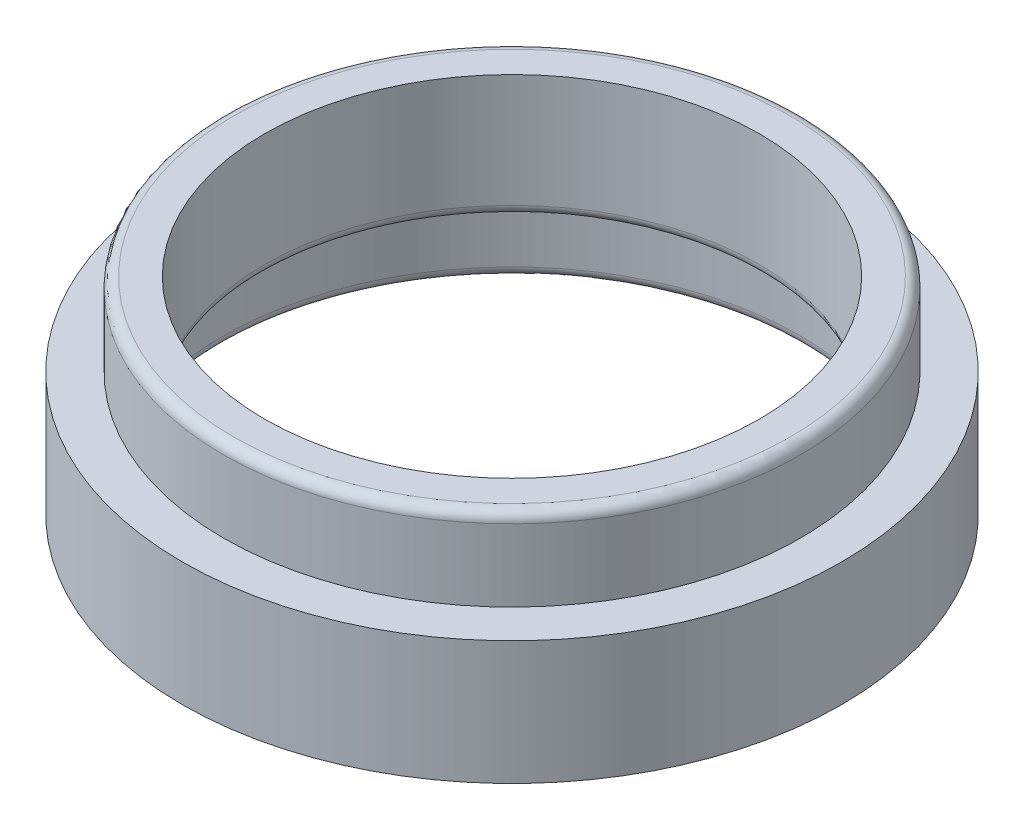
ISO-10303-21;
HEADER;
FILE_DESCRIPTION(('STEP AP214'),'2;1');
FILE_NAME('part.step','',(''),(''),'','','');
FILE_SCHEMA(('AUTOMOTIVE_DESIGN { 1 0 10303 214 1 1 1 1 }'));
ENDSEC;
DATA;
#1=APPLICATION_CONTEXT('core data for automotive mechanical design processes');
#2=APPLICATION_PROTOCOL_DEFINITION('international standard','automotive_design',2000,#1);
#3=PRODUCT_CONTEXT('',#1,'mechanical');
#4=PRODUCT('Part','Part','',(#3));
#5=PRODUCT_RELATED_PRODUCT_CATEGORY('part','',(#4));
#6=PRODUCT_DEFINITION_FORMATION('','',#4);
#7=PRODUCT_DEFINITION_CONTEXT('part definition',#1,'design');
#8=PRODUCT_DEFINITION('design','',#6,#7);
#9=PRODUCT_DEFINITION_SHAPE('','',#8);
#10=(LENGTH_UNIT() NAMED_UNIT(*) SI_UNIT(.MILLI.,.METRE.));
#11=(NAMED_UNIT(*) PLANE_ANGLE_UNIT() SI_UNIT($,.RADIAN.));
#12=(NAMED_UNIT(*) SI_UNIT($,.STERADIAN.) SOLID_ANGLE_UNIT());
#13=UNCERTAINTY_MEASURE_WITH_UNIT(LENGTH_MEASURE(1.E-05),#10,'distance_accuracy_value','');
#14=(GEOMETRIC_REPRESENTATION_CONTEXT(3) GLOBAL_UNCERTAINTY_ASSIGNED_CONTEXT((#13)) GLOBAL_UNIT_ASSIGNED_CONTEXT((#10,
#11,#12)) REPRESENTATION_CONTEXT('',''));
#15=CARTESIAN_POINT('',(0.,0.,0.));
#16=DIRECTION('',(0.,0.,1.));
#17=DIRECTION('',(1.,0.,0.));
#18=AXIS2_PLACEMENT_3D('',#15,#16,#17);
#19=CARTESIAN_POINT('',(0.,11.1125,-19.05));
#20=DIRECTION('',(0.,1.,0.));
#21=DIRECTION('',(0.,0.,1.));
#22=AXIS2_PLACEMENT_3D('',#19,#20,#21);
#23=PLANE('',#22);
#24=CARTESIAN_POINT('',(0.,11.1125,0.));
#25=DIRECTION('',(0.,1.,0.));
#26=DIRECTION('',(0.,0.,1.));
#27=AXIS2_PLACEMENT_3D('',#24,#25,#26);
#28=CIRCLE('',#27,21.43125);
#29=CARTESIAN_POINT('',(0.,11.1125,21.43125));
#30=VERTEX_POINT('',#29);
#31=EDGE_CURVE('E10',#30,#30,#28,.T.);
#32=ORIENTED_EDGE('',*,*,#31,.T.);
#33=EDGE_LOOP('',(#32));
#34=FACE_BOUND('',#33,.T.);
#35=CARTESIAN_POINT('',(0.,11.1125,0.));
#36=DIRECTION('',(0.,-1.,0.));
#37=DIRECTION('',(0.,0.,-1.));
#38=AXIS2_PLACEMENT_3D('',#35,#36,#37);
#39=CIRCLE('',#38,19.05);
#40=CARTESIAN_POINT('',(0.,11.1125,-19.05));
#41=VERTEX_POINT('',#40);
#42=EDGE_CURVE('E74',#41,#41,#39,.T.);
#43=ORIENTED_EDGE('',*,*,#42,.T.);
#44=EDGE_LOOP('',(#43));
#45=FACE_BOUND('',#44,.T.);
#46=ADVANCED_FACE('F33',(#34,#45),#23,.T.);
#47=CARTESIAN_POINT('',(0.,-32.3252119356495,0.));
#48=DIRECTION('',(0.,-1.,0.));
#49=DIRECTION('',(0.,0.,-1.));
#50=AXIS2_PLACEMENT_3D('',#47,#48,#49);
#51=CYLINDRICAL_SURFACE('',#50,22.225);
#52=CARTESIAN_POINT('',(0.,10.31875,0.));
#53=DIRECTION('',(0.,1.,0.));
#54=DIRECTION('',(0.,0.,1.));
#55=AXIS2_PLACEMENT_3D('',#52,#53,#54);
#56=CIRCLE('',#55,22.225);
#57=CARTESIAN_POINT('',(0.,10.31875,22.225));
#58=VERTEX_POINT('',#57);
#59=EDGE_CURVE('E40',#58,#58,#56,.F.);
#60=ORIENTED_EDGE('',*,*,#59,.T.);
#61=EDGE_LOOP('',(#60));
#62=FACE_BOUND('',#61,.T.);
#63=CARTESIAN_POINT('',(0.,4.7625,0.));
#64=DIRECTION('',(0.,-1.,0.));
#65=DIRECTION('',(0.,0.,-1.));
#66=AXIS2_PLACEMENT_3D('',#63,#64,#65);
#67=CIRCLE('',#66,22.225);
#68=CARTESIAN_POINT('',(0.,4.7625,-22.225));
#69=VERTEX_POINT('',#68);
#70=EDGE_CURVE('E65',#69,#69,#67,.T.);
#71=ORIENTED_EDGE('',*,*,#70,.F.);
#72=EDGE_LOOP('',(#71));
#73=FACE_BOUND('',#72,.T.);
#74=ADVANCED_FACE('F96',(#62,#73),#51,.T.);
#75=CARTESIAN_POINT('',(0.,4.7625,-22.225));
#76=DIRECTION('',(0.,1.,0.));
#77=DIRECTION('',(0.,0.,1.));
#78=AXIS2_PLACEMENT_3D('',#75,#76,#77);
#79=PLANE('',#78);
#80=ORIENTED_EDGE('',*,*,#70,.T.);
#81=EDGE_LOOP('',(#80));
#82=FACE_BOUND('',#81,.T.);
#83=CARTESIAN_POINT('',(0.,4.7625,0.));
#84=DIRECTION('',(0.,-1.,0.));
#85=DIRECTION('',(0.,0.,-1.));
#86=AXIS2_PLACEMENT_3D('',#83,#84,#85);
#87=CIRCLE('',#86,25.4);
#88=CARTESIAN_POINT('',(0.,4.7625,-25.4));
#89=VERTEX_POINT('',#88);
#90=EDGE_CURVE('E68',#89,#89,#87,.T.);
#91=ORIENTED_EDGE('',*,*,#90,.F.);
#92=EDGE_LOOP('',(#91));
#93=FACE_BOUND('',#92,.T.);
#94=ADVANCED_FACE('F101',(#82,#93),#79,.T.);
#95=CARTESIAN_POINT('',(0.,-32.3252119356495,0.));
#96=DIRECTION('',(0.,-1.,0.));
#97=DIRECTION('',(0.,0.,-1.));
#98=AXIS2_PLACEMENT_3D('',#95,#96,#97);
#99=CYLINDRICAL_SURFACE('',#98,25.4);
#100=ORIENTED_EDGE('',*,*,#90,.T.);
#101=EDGE_LOOP('',(#100));
#102=FACE_BOUND('',#101,.T.);
#103=CARTESIAN_POINT('',(0.,-4.7625,0.));
#104=DIRECTION('',(0.,-1.,0.));
#105=DIRECTION('',(0.,0.,-1.));
#106=AXIS2_PLACEMENT_3D('',#103,#104,#105);
#107=CIRCLE('',#106,25.4);
#108=CARTESIAN_POINT('',(0.,-4.7625,-25.4));
#109=VERTEX_POINT('',#108);
#110=EDGE_CURVE('E71',#109,#109,#107,.T.);
#111=ORIENTED_EDGE('',*,*,#110,.F.);
#112=EDGE_LOOP('',(#111));
#113=FACE_BOUND('',#112,.T.);
#114=ADVANCED_FACE('F125',(#102,#113),#99,.T.);
#115=CARTESIAN_POINT('',(0.,-4.7625,-25.4));
#116=DIRECTION('',(0.,-1.,0.));
#117=DIRECTION('',(0.,0.,-1.));
#118=AXIS2_PLACEMENT_3D('',#115,#116,#117);
#119=PLANE('',#118);
#120=CARTESIAN_POINT('',(0.,-4.7625,0.));
#121=DIRECTION('',(0.,-1.,0.));
#122=DIRECTION('',(0.,0.,-1.));
#123=AXIS2_PLACEMENT_3D('',#120,#121,#122);
#124=CIRCLE('',#123,23.01875);
#125=CARTESIAN_POINT('',(0.,-4.7625,-23.01875));
#126=VERTEX_POINT('',#125);
#127=EDGE_CURVE('E44',#126,#126,#124,.F.);
#128=ORIENTED_EDGE('',*,*,#127,.T.);
#129=EDGE_LOOP('',(#128));
#130=FACE_BOUND('',#129,.T.);
#131=ORIENTED_EDGE('',*,*,#110,.T.);
#132=EDGE_LOOP('',(#131));
#133=FACE_BOUND('',#132,.T.);
#134=ADVANCED_FACE('F119',(#130,#133),#119,.T.);
#135=CARTESIAN_POINT('',(0.,-32.3252119356495,0.));
#136=DIRECTION('',(0.,-1.,0.));
#137=DIRECTION('',(0.,0.,-1.));
#138=AXIS2_PLACEMENT_3D('',#135,#136,#137);
#139=CYLINDRICAL_SURFACE('',#138,22.225);
#140=CARTESIAN_POINT('',(0.,0.793750000000003,0.));
#141=DIRECTION('',(0.,-1.,0.));
#142=DIRECTION('',(0.,0.,-1.));
#143=AXIS2_PLACEMENT_3D('',#140,#141,#142);
#144=CIRCLE('',#143,22.225);
#145=CARTESIAN_POINT('',(0.,0.793750000000003,-22.225));
#146=VERTEX_POINT('',#145);
#147=EDGE_CURVE('E48',#146,#146,#144,.F.);
#148=ORIENTED_EDGE('',*,*,#147,.T.);
#149=EDGE_LOOP('',(#148));
#150=FACE_BOUND('',#149,.T.);
#151=CARTESIAN_POINT('',(0.,-3.96875,0.));
#152=DIRECTION('',(0.,-1.,0.));
#153=DIRECTION('',(0.,0.,-1.));
#154=AXIS2_PLACEMENT_3D('',#151,#152,#153);
#155=CIRCLE('',#154,22.225);
#156=CARTESIAN_POINT('',(0.,-3.96875,-22.225));
#157=VERTEX_POINT('',#156);
#158=EDGE_CURVE('E53',#157,#157,#155,.T.);
#159=ORIENTED_EDGE('',*,*,#158,.T.);
#160=EDGE_LOOP('',(#159));
#161=FACE_BOUND('',#160,.T.);
#162=ADVANCED_FACE('F92',(#150,#161),#139,.F.);
#163=CARTESIAN_POINT('',(0.,1.5875,-22.225));
#164=DIRECTION('',(0.,-1.,0.));
#165=DIRECTION('',(0.,0.,-1.));
#166=AXIS2_PLACEMENT_3D('',#163,#164,#165);
#167=PLANE('',#166);
#168=CARTESIAN_POINT('',(0.,1.5875,0.));
#169=DIRECTION('',(0.,-1.,0.));
#170=DIRECTION('',(0.,0.,-1.));
#171=AXIS2_PLACEMENT_3D('',#168,#169,#170);
#172=CIRCLE('',#171,19.84375);
#173=CARTESIAN_POINT('',(0.,1.5875,-19.84375));
#174=VERTEX_POINT('',#173);
#175=EDGE_CURVE('E56',#174,#174,#172,.F.);
#176=ORIENTED_EDGE('',*,*,#175,.T.);
#177=EDGE_LOOP('',(#176));
#178=FACE_BOUND('',#177,.T.);
#179=CARTESIAN_POINT('',(0.,1.5875,0.));
#180=DIRECTION('',(0.,-1.,0.));
#181=DIRECTION('',(0.,0.,-1.));
#182=AXIS2_PLACEMENT_3D('',#179,#180,#181);
#183=CIRCLE('',#182,21.43125);
#184=CARTESIAN_POINT('',(0.,1.5875,-21.43125));
#185=VERTEX_POINT('',#184);
#186=EDGE_CURVE('E59',#185,#185,#183,.T.);
#187=ORIENTED_EDGE('',*,*,#186,.T.);
#188=EDGE_LOOP('',(#187));
#189=FACE_BOUND('',#188,.T.);
#190=ADVANCED_FACE('F82',(#178,#189),#167,.T.);
#191=CARTESIAN_POINT('',(0.,-32.3252119356495,0.));
#192=DIRECTION('',(0.,-1.,0.));
#193=DIRECTION('',(0.,0.,-1.));
#194=AXIS2_PLACEMENT_3D('',#191,#192,#193);
#195=CYLINDRICAL_SURFACE('',#194,19.05);
#196=CARTESIAN_POINT('',(0.,2.38125,0.));
#197=DIRECTION('',(0.,-1.,0.));
#198=DIRECTION('',(0.,0.,-1.));
#199=AXIS2_PLACEMENT_3D('',#196,#197,#198);
#200=CIRCLE('',#199,19.05);
#201=CARTESIAN_POINT('',(0.,2.38125,-19.05));
#202=VERTEX_POINT('',#201);
#203=EDGE_CURVE('E62',#202,#202,#200,.T.);
#204=ORIENTED_EDGE('',*,*,#203,.T.);
#205=EDGE_LOOP('',(#204));
#206=FACE_BOUND('',#205,.T.);
#207=ORIENTED_EDGE('',*,*,#42,.F.);
#208=EDGE_LOOP('',(#207));
#209=FACE_BOUND('',#208,.T.);
#210=ADVANCED_FACE('F79',(#206,#209),#195,.F.);
#211=CARTESIAN_POINT('',(0.,2.38125,0.));
#212=DIRECTION('',(0.,-1.,0.));
#213=DIRECTION('',(0.,0.,-1.));
#214=AXIS2_PLACEMENT_3D('',#211,#212,#213);
#215=TOROIDAL_SURFACE('',#214,19.84375,0.79375);
#216=ORIENTED_EDGE('',*,*,#175,.F.);
#217=EDGE_LOOP('',(#216));
#218=FACE_BOUND('',#217,.T.);
#219=ORIENTED_EDGE('',*,*,#203,.F.);
#220=EDGE_LOOP('',(#219));
#221=FACE_BOUND('',#220,.T.);
#222=ADVANCED_FACE('F81',(#218,#221),#215,.T.);
#223=CARTESIAN_POINT('',(0.,0.793750000000003,0.));
#224=DIRECTION('',(0.,-1.,0.));
#225=DIRECTION('',(0.,0.,-1.));
#226=AXIS2_PLACEMENT_3D('',#223,#224,#225);
#227=TOROIDAL_SURFACE('',#226,21.43125,0.79375);
#228=ORIENTED_EDGE('',*,*,#147,.F.);
#229=EDGE_LOOP('',(#228));
#230=FACE_BOUND('',#229,.T.);
#231=ORIENTED_EDGE('',*,*,#186,.F.);
#232=EDGE_LOOP('',(#231));
#233=FACE_BOUND('',#232,.T.);
#234=ADVANCED_FACE('F89',(#230,#233),#227,.F.);
#235=CARTESIAN_POINT('',(0.,-3.96875,0.));
#236=DIRECTION('',(0.,-1.,0.));
#237=DIRECTION('',(0.,0.,-1.));
#238=AXIS2_PLACEMENT_3D('',#235,#236,#237);
#239=TOROIDAL_SURFACE('',#238,23.01875,0.79375);
#240=ORIENTED_EDGE('',*,*,#127,.F.);
#241=EDGE_LOOP('',(#240));
#242=FACE_BOUND('',#241,.T.);
#243=ORIENTED_EDGE('',*,*,#158,.F.);
#244=EDGE_LOOP('',(#243));
#245=FACE_BOUND('',#244,.T.);
#246=ADVANCED_FACE('F106',(#242,#245),#239,.T.);
#247=CARTESIAN_POINT('',(0.,10.31875,0.));
#248=DIRECTION('',(0.,1.,0.));
#249=DIRECTION('',(0.,0.,1.));
#250=AXIS2_PLACEMENT_3D('',#247,#248,#249);
#251=TOROIDAL_SURFACE('',#250,21.43125,0.79375);
#252=ORIENTED_EDGE('',*,*,#31,.F.);
#253=EDGE_LOOP('',(#252));
#254=FACE_BOUND('',#253,.T.);
#255=ORIENTED_EDGE('',*,*,#59,.F.);
#256=EDGE_LOOP('',(#255));
#257=FACE_BOUND('',#256,.T.);
#258=ADVANCED_FACE('F35',(#254,#257),#251,.T.);
#259=CLOSED_SHELL('',(#46,#74,#94,#114,#134,#162,#190,#210,#222,#234,#246,#258));
#260=MANIFOLD_SOLID_BREP('B2',#259);
#261=ADVANCED_BREP_SHAPE_REPRESENTATION('',(#18,#260),#14);
#262=SHAPE_DEFINITION_REPRESENTATION(#9,#261);
ENDSEC;
END-ISO-10303-21;
